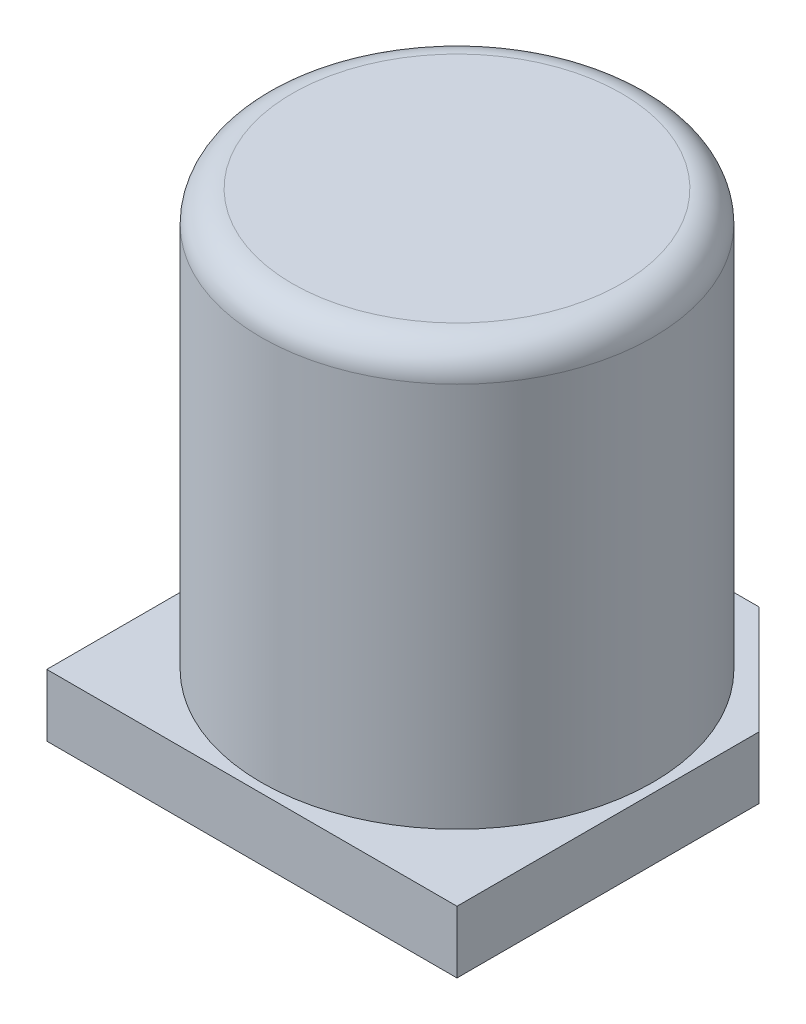
ISO-10303-21;
HEADER;
FILE_DESCRIPTION(('STEP AP214'),'2;1');
FILE_NAME('part.step','',(''),(''),'','','');
FILE_SCHEMA(('AUTOMOTIVE_DESIGN { 1 0 10303 214 1 1 1 1 }'));
ENDSEC;
DATA;
#1=APPLICATION_CONTEXT('core data for automotive mechanical design processes');
#2=APPLICATION_PROTOCOL_DEFINITION('international standard','automotive_design',2000,#1);
#3=PRODUCT_CONTEXT('',#1,'mechanical');
#4=PRODUCT('Part','Part','',(#3));
#5=PRODUCT_RELATED_PRODUCT_CATEGORY('part','',(#4));
#6=PRODUCT_DEFINITION_FORMATION('','',#4);
#7=PRODUCT_DEFINITION_CONTEXT('part definition',#1,'design');
#8=PRODUCT_DEFINITION('design','',#6,#7);
#9=PRODUCT_DEFINITION_SHAPE('','',#8);
#10=(LENGTH_UNIT() NAMED_UNIT(*) SI_UNIT(.MILLI.,.METRE.));
#11=(NAMED_UNIT(*) PLANE_ANGLE_UNIT() SI_UNIT($,.RADIAN.));
#12=(NAMED_UNIT(*) SI_UNIT($,.STERADIAN.) SOLID_ANGLE_UNIT());
#13=UNCERTAINTY_MEASURE_WITH_UNIT(LENGTH_MEASURE(1.E-05),#10,'distance_accuracy_value','');
#14=(GEOMETRIC_REPRESENTATION_CONTEXT(3) GLOBAL_UNCERTAINTY_ASSIGNED_CONTEXT((#13)) GLOBAL_UNIT_ASSIGNED_CONTEXT((#10,
#11,#12)) REPRESENTATION_CONTEXT('',''));
#15=CARTESIAN_POINT('',(0.,0.,0.));
#16=DIRECTION('',(0.,0.,1.));
#17=DIRECTION('',(1.,0.,0.));
#18=AXIS2_PLACEMENT_3D('',#15,#16,#17);
#19=CARTESIAN_POINT('',(0.,0.,0.));
#20=DIRECTION('',(0.,-1.,0.));
#21=DIRECTION('',(0.,0.,-1.));
#22=AXIS2_PLACEMENT_3D('',#19,#20,#21);
#23=PLANE('',#22);
#24=DIRECTION('',(0.,0.,1.));
#25=VECTOR('',#24,1.);
#26=CARTESIAN_POINT('',(-3.3,0.,3.3));
#27=LINE('',#26,#25);
#28=CARTESIAN_POINT('',(-3.3,0.,-1.562548268927));
#29=VERTEX_POINT('',#28);
#30=CARTESIAN_POINT('',(-3.3,0.,3.3));
#31=VERTEX_POINT('',#30);
#32=EDGE_CURVE('E140',#29,#31,#27,.T.);
#33=ORIENTED_EDGE('',*,*,#32,.F.);
#34=DIRECTION('',(0.70710678118655,0.,-0.707106781186545));
#35=VECTOR('',#34,1.);
#36=CARTESIAN_POINT('',(-3.3,0.,-1.56254826892701));
#37=LINE('',#36,#35);
#38=CARTESIAN_POINT('',(-1.56254826892699,0.,-3.3));
#39=VERTEX_POINT('',#38);
#40=EDGE_CURVE('E132',#29,#39,#37,.T.);
#41=ORIENTED_EDGE('',*,*,#40,.T.);
#42=DIRECTION('',(-1.,0.,0.));
#43=VECTOR('',#42,1.);
#44=CARTESIAN_POINT('',(-3.3,0.,-3.3));
#45=LINE('',#44,#43);
#46=CARTESIAN_POINT('',(1.56254826892701,0.,-3.3));
#47=VERTEX_POINT('',#46);
#48=EDGE_CURVE('E129',#47,#39,#45,.T.);
#49=ORIENTED_EDGE('',*,*,#48,.F.);
#50=DIRECTION('',(0.707106781186545,0.,0.70710678118655));
#51=VECTOR('',#50,1.);
#52=CARTESIAN_POINT('',(1.56254826892701,0.,-3.3));
#53=LINE('',#52,#51);
#54=CARTESIAN_POINT('',(3.3,0.,-1.56254826892699));
#55=VERTEX_POINT('',#54);
#56=EDGE_CURVE('E121',#47,#55,#53,.T.);
#57=ORIENTED_EDGE('',*,*,#56,.T.);
#58=DIRECTION('',(0.,0.,-1.));
#59=VECTOR('',#58,1.);
#60=CARTESIAN_POINT('',(3.3,0.,-3.3));
#61=LINE('',#60,#59);
#62=CARTESIAN_POINT('',(3.3,0.,3.3));
#63=VERTEX_POINT('',#62);
#64=EDGE_CURVE('E118',#63,#55,#61,.T.);
#65=ORIENTED_EDGE('',*,*,#64,.F.);
#66=DIRECTION('',(1.,0.,0.));
#67=VECTOR('',#66,1.);
#68=CARTESIAN_POINT('',(3.3,0.,3.3));
#69=LINE('',#68,#67);
#70=EDGE_CURVE('E143',#31,#63,#69,.T.);
#71=ORIENTED_EDGE('',*,*,#70,.F.);
#72=EDGE_LOOP('',(#33,#41,#49,#57,#65,#71));
#73=FACE_BOUND('',#72,.T.);
#74=ADVANCED_FACE('F17',(#73),#23,.T.);
#75=CARTESIAN_POINT('',(3.15,7.7,0.));
#76=DIRECTION('',(0.,1.,0.));
#77=DIRECTION('',(0.,0.,1.));
#78=AXIS2_PLACEMENT_3D('',#75,#76,#77);
#79=PLANE('',#78);
#80=CARTESIAN_POINT('',(0.,7.7,0.));
#81=DIRECTION('',(0.,-1.,0.));
#82=DIRECTION('',(0.,0.,-1.));
#83=AXIS2_PLACEMENT_3D('',#80,#81,#82);
#84=CIRCLE('',#83,2.65);
#85=CARTESIAN_POINT('',(0.,7.7,-2.65));
#86=VERTEX_POINT('',#85);
#87=CARTESIAN_POINT('',(0.,7.7,2.65));
#88=VERTEX_POINT('',#87);
#89=EDGE_CURVE('E81',#86,#88,#84,.T.);
#90=ORIENTED_EDGE('',*,*,#89,.F.);
#91=CARTESIAN_POINT('',(0.,7.7,0.));
#92=DIRECTION('',(0.,-1.,0.));
#93=DIRECTION('',(0.,0.,1.));
#94=AXIS2_PLACEMENT_3D('',#91,#92,#93);
#95=CIRCLE('',#94,2.65);
#96=EDGE_CURVE('E76',#88,#86,#95,.T.);
#97=ORIENTED_EDGE('',*,*,#96,.F.);
#98=EDGE_LOOP('',(#90,#97));
#99=FACE_BOUND('',#98,.T.);
#100=ADVANCED_FACE('F80',(#99),#79,.T.);
#101=CARTESIAN_POINT('',(3.3,1.,3.3));
#102=DIRECTION('',(0.,0.,1.));
#103=DIRECTION('',(1.,0.,0.));
#104=AXIS2_PLACEMENT_3D('',#101,#102,#103);
#105=PLANE('',#104);
#106=DIRECTION('',(1.,0.,0.));
#107=VECTOR('',#106,1.);
#108=CARTESIAN_POINT('',(0.,1.,3.3));
#109=LINE('',#108,#107);
#110=CARTESIAN_POINT('',(3.3,1.,3.3));
#111=VERTEX_POINT('',#110);
#112=CARTESIAN_POINT('',(-3.3,1.,3.3));
#113=VERTEX_POINT('',#112);
#114=EDGE_CURVE('E89',#111,#113,#109,.F.);
#115=ORIENTED_EDGE('',*,*,#114,.T.);
#116=DIRECTION('',(0.,1.,0.));
#117=VECTOR('',#116,1.);
#118=CARTESIAN_POINT('',(-3.3,1.,3.3));
#119=LINE('',#118,#117);
#120=EDGE_CURVE('E137',#31,#113,#119,.T.);
#121=ORIENTED_EDGE('',*,*,#120,.F.);
#122=ORIENTED_EDGE('',*,*,#70,.T.);
#123=DIRECTION('',(0.,1.,0.));
#124=VECTOR('',#123,1.);
#125=CARTESIAN_POINT('',(3.3,1.,3.3));
#126=LINE('',#125,#124);
#127=EDGE_CURVE('E83',#111,#63,#126,.F.);
#128=ORIENTED_EDGE('',*,*,#127,.F.);
#129=EDGE_LOOP('',(#115,#121,#122,#128));
#130=FACE_BOUND('',#129,.T.);
#131=ADVANCED_FACE('F155',(#130),#105,.T.);
#132=CARTESIAN_POINT('',(-3.3,1.,3.3));
#133=DIRECTION('',(-1.,0.,0.));
#134=DIRECTION('',(0.,0.,1.));
#135=AXIS2_PLACEMENT_3D('',#132,#133,#134);
#136=PLANE('',#135);
#137=ORIENTED_EDGE('',*,*,#32,.T.);
#138=ORIENTED_EDGE('',*,*,#120,.T.);
#139=DIRECTION('',(0.,0.,-1.));
#140=VECTOR('',#139,1.);
#141=CARTESIAN_POINT('',(-3.3,1.,0.));
#142=LINE('',#141,#140);
#143=CARTESIAN_POINT('',(-3.3,1.,-1.562548268927));
#144=VERTEX_POINT('',#143);
#145=EDGE_CURVE('E200',#113,#144,#142,.T.);
#146=ORIENTED_EDGE('',*,*,#145,.T.);
#147=DIRECTION('',(0.,1.,0.));
#148=VECTOR('',#147,1.);
#149=CARTESIAN_POINT('',(-3.3,1.,-1.562548268927));
#150=LINE('',#149,#148);
#151=EDGE_CURVE('E134',#144,#29,#150,.F.);
#152=ORIENTED_EDGE('',*,*,#151,.T.);
#153=EDGE_LOOP('',(#137,#138,#146,#152));
#154=FACE_BOUND('',#153,.T.);
#155=ADVANCED_FACE('F159',(#154),#136,.T.);
#156=CARTESIAN_POINT('',(-3.3,1.,-1.56254826892701));
#157=DIRECTION('',(0.707106781186545,0.,0.70710678118655));
#158=DIRECTION('',(0.70710678118655,0.,-0.707106781186545));
#159=AXIS2_PLACEMENT_3D('',#156,#157,#158);
#160=PLANE('',#159);
#161=DIRECTION('',(0.,1.,0.));
#162=VECTOR('',#161,1.);
#163=CARTESIAN_POINT('',(-1.56254826892699,1.,-3.3));
#164=LINE('',#163,#162);
#165=CARTESIAN_POINT('',(-1.56254826892699,1.,-3.3));
#166=VERTEX_POINT('',#165);
#167=EDGE_CURVE('E126',#39,#166,#164,.T.);
#168=ORIENTED_EDGE('',*,*,#167,.F.);
#169=ORIENTED_EDGE('',*,*,#40,.F.);
#170=ORIENTED_EDGE('',*,*,#151,.F.);
#171=DIRECTION('',(0.70710678118655,0.,-0.707106781186545));
#172=VECTOR('',#171,1.);
#173=CARTESIAN_POINT('',(-3.3,1.,-1.562548268927));
#174=LINE('',#173,#172);
#175=EDGE_CURVE('E198',#144,#166,#174,.T.);
#176=ORIENTED_EDGE('',*,*,#175,.T.);
#177=EDGE_LOOP('',(#168,#169,#170,#176));
#178=FACE_BOUND('',#177,.T.);
#179=ADVANCED_FACE('F163',(#178),#160,.F.);
#180=CARTESIAN_POINT('',(-3.3,1.,-3.3));
#181=DIRECTION('',(0.,0.,-1.));
#182=DIRECTION('',(-1.,0.,0.));
#183=AXIS2_PLACEMENT_3D('',#180,#181,#182);
#184=PLANE('',#183);
#185=ORIENTED_EDGE('',*,*,#48,.T.);
#186=ORIENTED_EDGE('',*,*,#167,.T.);
#187=DIRECTION('',(1.,0.,0.));
#188=VECTOR('',#187,1.);
#189=CARTESIAN_POINT('',(0.,1.,-3.3));
#190=LINE('',#189,#188);
#191=CARTESIAN_POINT('',(1.56254826892701,1.,-3.3));
#192=VERTEX_POINT('',#191);
#193=EDGE_CURVE('E194',#166,#192,#190,.T.);
#194=ORIENTED_EDGE('',*,*,#193,.T.);
#195=DIRECTION('',(0.,1.,0.));
#196=VECTOR('',#195,1.);
#197=CARTESIAN_POINT('',(1.56254826892701,1.,-3.3));
#198=LINE('',#197,#196);
#199=EDGE_CURVE('E123',#192,#47,#198,.F.);
#200=ORIENTED_EDGE('',*,*,#199,.T.);
#201=EDGE_LOOP('',(#185,#186,#194,#200));
#202=FACE_BOUND('',#201,.T.);
#203=ADVANCED_FACE('F167',(#202),#184,.T.);
#204=CARTESIAN_POINT('',(1.56254826892701,1.,-3.3));
#205=DIRECTION('',(-0.70710678118655,0.,0.707106781186545));
#206=DIRECTION('',(0.707106781186545,0.,0.70710678118655));
#207=AXIS2_PLACEMENT_3D('',#204,#205,#206);
#208=PLANE('',#207);
#209=DIRECTION('',(0.,1.,0.));
#210=VECTOR('',#209,1.);
#211=CARTESIAN_POINT('',(3.3,1.,-1.56254826892699));
#212=LINE('',#211,#210);
#213=CARTESIAN_POINT('',(3.3,1.,-1.56254826892699));
#214=VERTEX_POINT('',#213);
#215=EDGE_CURVE('E116',#55,#214,#212,.T.);
#216=ORIENTED_EDGE('',*,*,#215,.F.);
#217=ORIENTED_EDGE('',*,*,#56,.F.);
#218=ORIENTED_EDGE('',*,*,#199,.F.);
#219=DIRECTION('',(0.707106781186545,0.,0.70710678118655));
#220=VECTOR('',#219,1.);
#221=CARTESIAN_POINT('',(1.56254826892701,1.,-3.3));
#222=LINE('',#221,#220);
#223=EDGE_CURVE('E37',#192,#214,#222,.T.);
#224=ORIENTED_EDGE('',*,*,#223,.T.);
#225=EDGE_LOOP('',(#216,#217,#218,#224));
#226=FACE_BOUND('',#225,.T.);
#227=ADVANCED_FACE('F170',(#226),#208,.F.);
#228=CARTESIAN_POINT('',(3.3,1.,-3.3));
#229=DIRECTION('',(1.,0.,0.));
#230=DIRECTION('',(0.,0.,-1.));
#231=AXIS2_PLACEMENT_3D('',#228,#229,#230);
#232=PLANE('',#231);
#233=DIRECTION('',(0.,0.,-1.));
#234=VECTOR('',#233,1.);
#235=CARTESIAN_POINT('',(3.3,1.,0.));
#236=LINE('',#235,#234);
#237=EDGE_CURVE('E189',#214,#111,#236,.F.);
#238=ORIENTED_EDGE('',*,*,#237,.T.);
#239=ORIENTED_EDGE('',*,*,#127,.T.);
#240=ORIENTED_EDGE('',*,*,#64,.T.);
#241=ORIENTED_EDGE('',*,*,#215,.T.);
#242=EDGE_LOOP('',(#238,#239,#240,#241));
#243=FACE_BOUND('',#242,.T.);
#244=ADVANCED_FACE('F106',(#243),#232,.T.);
#245=CARTESIAN_POINT('',(0.,7.2,0.));
#246=DIRECTION('',(0.,1.,0.));
#247=DIRECTION('',(0.,0.,1.));
#248=AXIS2_PLACEMENT_3D('',#245,#246,#247);
#249=TOROIDAL_SURFACE('',#248,2.65,0.5);
#250=ORIENTED_EDGE('',*,*,#96,.T.);
#251=ORIENTED_EDGE('',*,*,#89,.T.);
#252=EDGE_LOOP('',(#250,#251));
#253=FACE_BOUND('',#252,.T.);
#254=CARTESIAN_POINT('',(0.,7.2,0.));
#255=DIRECTION('',(0.,-1.,0.));
#256=DIRECTION('',(0.,0.,-1.));
#257=AXIS2_PLACEMENT_3D('',#254,#255,#256);
#258=CIRCLE('',#257,3.15);
#259=CARTESIAN_POINT('',(0.,7.2,-3.15));
#260=VERTEX_POINT('',#259);
#261=EDGE_CURVE('E28',#260,#260,#258,.T.);
#262=ORIENTED_EDGE('',*,*,#261,.F.);
#263=EDGE_LOOP('',(#262));
#264=FACE_BOUND('',#263,.T.);
#265=ADVANCED_FACE('F87',(#253,#264),#249,.T.);
#266=CARTESIAN_POINT('',(0.,1.,0.));
#267=DIRECTION('',(0.,-1.,0.));
#268=DIRECTION('',(0.,0.,-1.));
#269=AXIS2_PLACEMENT_3D('',#266,#267,#268);
#270=PLANE('',#269);
#271=ORIENTED_EDGE('',*,*,#223,.F.);
#272=ORIENTED_EDGE('',*,*,#193,.F.);
#273=ORIENTED_EDGE('',*,*,#175,.F.);
#274=ORIENTED_EDGE('',*,*,#145,.F.);
#275=ORIENTED_EDGE('',*,*,#114,.F.);
#276=ORIENTED_EDGE('',*,*,#237,.F.);
#277=EDGE_LOOP('',(#271,#272,#273,#274,#275,#276));
#278=FACE_BOUND('',#277,.T.);
#279=CARTESIAN_POINT('',(0.,1.,0.));
#280=DIRECTION('',(0.,-1.,0.));
#281=DIRECTION('',(0.,0.,-1.));
#282=AXIS2_PLACEMENT_3D('',#279,#280,#281);
#283=CIRCLE('',#282,3.15);
#284=CARTESIAN_POINT('',(0.,1.,-3.15));
#285=VERTEX_POINT('',#284);
#286=EDGE_CURVE('E11',#285,#285,#283,.F.);
#287=ORIENTED_EDGE('',*,*,#286,.F.);
#288=EDGE_LOOP('',(#287));
#289=FACE_BOUND('',#288,.T.);
#290=ADVANCED_FACE('F105',(#278,#289),#270,.F.);
#291=CARTESIAN_POINT('',(0.,7.7,0.));
#292=DIRECTION('',(0.,-1.,0.));
#293=DIRECTION('',(0.,0.,-1.));
#294=AXIS2_PLACEMENT_3D('',#291,#292,#293);
#295=CYLINDRICAL_SURFACE('',#294,3.15);
#296=ORIENTED_EDGE('',*,*,#286,.T.);
#297=EDGE_LOOP('',(#296));
#298=FACE_BOUND('',#297,.T.);
#299=ORIENTED_EDGE('',*,*,#261,.T.);
#300=EDGE_LOOP('',(#299));
#301=FACE_BOUND('',#300,.T.);
#302=ADVANCED_FACE('F178',(#298,#301),#295,.T.);
#303=CLOSED_SHELL('',(#74,#100,#131,#155,#179,#203,#227,#244,#265,#290,#302));
#304=MANIFOLD_SOLID_BREP('B1',#303);
#305=ADVANCED_BREP_SHAPE_REPRESENTATION('',(#18,#304),#14);
#306=SHAPE_DEFINITION_REPRESENTATION(#9,#305);
ENDSEC;
END-ISO-10303-21;
